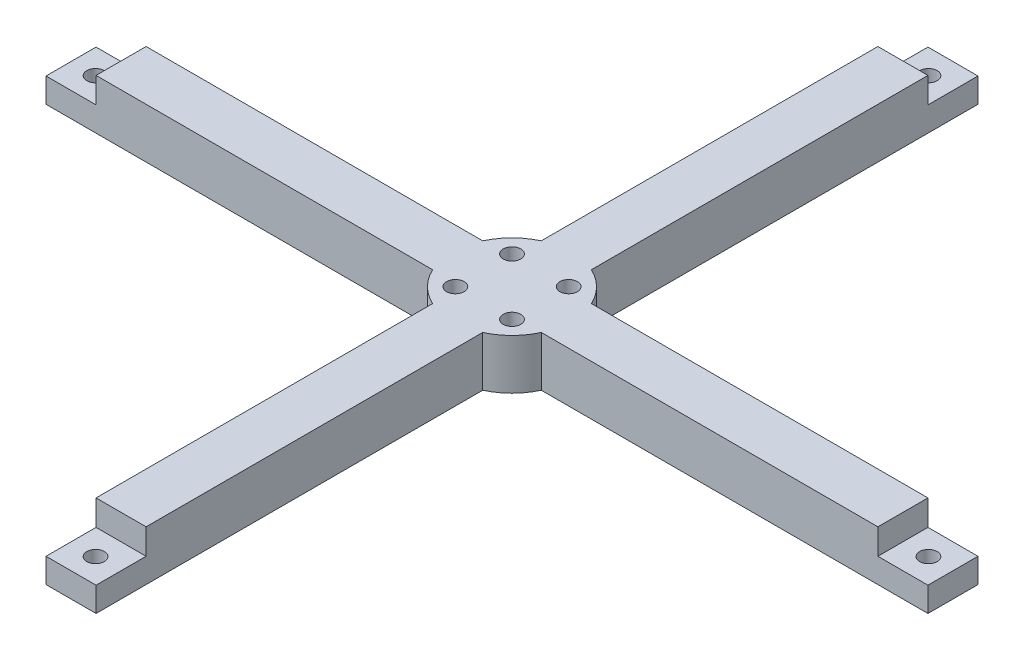
ISO-10303-21;
HEADER;
FILE_DESCRIPTION(('STEP AP214'),'2;1');
FILE_NAME('part.step','',(''),(''),'','','');
FILE_SCHEMA(('AUTOMOTIVE_DESIGN { 1 0 10303 214 1 1 1 1 }'));
ENDSEC;
DATA;
#1=APPLICATION_CONTEXT('core data for automotive mechanical design processes');
#2=APPLICATION_PROTOCOL_DEFINITION('international standard','automotive_design',2000,#1);
#3=PRODUCT_CONTEXT('',#1,'mechanical');
#4=PRODUCT('Part','Part','',(#3));
#5=PRODUCT_RELATED_PRODUCT_CATEGORY('part','',(#4));
#6=PRODUCT_DEFINITION_FORMATION('','',#4);
#7=PRODUCT_DEFINITION_CONTEXT('part definition',#1,'design');
#8=PRODUCT_DEFINITION('design','',#6,#7);
#9=PRODUCT_DEFINITION_SHAPE('','',#8);
#10=(LENGTH_UNIT() NAMED_UNIT(*) SI_UNIT(.MILLI.,.METRE.));
#11=(NAMED_UNIT(*) PLANE_ANGLE_UNIT() SI_UNIT($,.RADIAN.));
#12=(NAMED_UNIT(*) SI_UNIT($,.STERADIAN.) SOLID_ANGLE_UNIT());
#13=UNCERTAINTY_MEASURE_WITH_UNIT(LENGTH_MEASURE(1.E-05),#10,'distance_accuracy_value','');
#14=(GEOMETRIC_REPRESENTATION_CONTEXT(3) GLOBAL_UNCERTAINTY_ASSIGNED_CONTEXT((#13)) GLOBAL_UNIT_ASSIGNED_CONTEXT((#10,
#11,#12)) REPRESENTATION_CONTEXT('',''));
#15=CARTESIAN_POINT('',(0.,0.,0.));
#16=DIRECTION('',(0.,0.,1.));
#17=DIRECTION('',(1.,0.,0.));
#18=AXIS2_PLACEMENT_3D('',#15,#16,#17);
#19=CARTESIAN_POINT('',(0.,10.,0.));
#20=DIRECTION('',(0.,-1.,0.));
#21=DIRECTION('',(0.,0.,-1.));
#22=AXIS2_PLACEMENT_3D('',#19,#20,#21);
#23=CYLINDRICAL_SURFACE('',#22,11.95);
#24=CARTESIAN_POINT('',(0.,0.,0.));
#25=DIRECTION('',(0.,1.,0.));
#26=DIRECTION('',(0.,0.,1.));
#27=AXIS2_PLACEMENT_3D('',#24,#25,#26);
#28=CIRCLE('',#27,11.95);
#29=CARTESIAN_POINT('',(-10.8536860098309,0.,5.));
#30=VERTEX_POINT('',#29);
#31=CARTESIAN_POINT('',(-4.99999999999989,0.,10.853686009831));
#32=VERTEX_POINT('',#31);
#33=EDGE_CURVE('E788',#30,#32,#28,.T.);
#34=ORIENTED_EDGE('',*,*,#33,.T.);
#35=DIRECTION('',(0.,1.,0.));
#36=VECTOR('',#35,1.);
#37=CARTESIAN_POINT('',(-4.99999999999989,-87.9168844288129,10.853686009831));
#38=LINE('',#37,#36);
#39=CARTESIAN_POINT('',(-4.99999999999989,10.,10.853686009831));
#40=VERTEX_POINT('',#39);
#41=EDGE_CURVE('E378',#32,#40,#38,.T.);
#42=ORIENTED_EDGE('',*,*,#41,.T.);
#43=CARTESIAN_POINT('',(0.,10.,0.));
#44=DIRECTION('',(0.,1.,0.));
#45=DIRECTION('',(0.,0.,1.));
#46=AXIS2_PLACEMENT_3D('',#43,#44,#45);
#47=CIRCLE('',#46,11.95);
#48=CARTESIAN_POINT('',(-10.8536860098309,10.,5.));
#49=VERTEX_POINT('',#48);
#50=EDGE_CURVE('E323',#49,#40,#47,.T.);
#51=ORIENTED_EDGE('',*,*,#50,.F.);
#52=DIRECTION('',(0.,1.,0.));
#53=VECTOR('',#52,1.);
#54=CARTESIAN_POINT('',(-10.8536860098309,-87.9168844288127,5.));
#55=LINE('',#54,#53);
#56=EDGE_CURVE('E363',#30,#49,#55,.T.);
#57=ORIENTED_EDGE('',*,*,#56,.F.);
#58=EDGE_LOOP('',(#34,#42,#51,#57));
#59=FACE_BOUND('',#58,.T.);
#60=ADVANCED_FACE('F37',(#59),#23,.T.);
#61=CARTESIAN_POINT('',(-5.00000000000004,0.,-10.8536860098309));
#62=VERTEX_POINT('',#61);
#63=CARTESIAN_POINT('',(-10.8536860098309,0.,-5.));
#64=VERTEX_POINT('',#63);
#65=EDGE_CURVE('E284',#62,#64,#28,.T.);
#66=ORIENTED_EDGE('',*,*,#65,.T.);
#67=DIRECTION('',(0.,1.,0.));
#68=VECTOR('',#67,1.);
#69=CARTESIAN_POINT('',(-10.8536860098309,-87.9168844288127,-5.));
#70=LINE('',#69,#68);
#71=CARTESIAN_POINT('',(-10.8536860098309,10.,-5.));
#72=VERTEX_POINT('',#71);
#73=EDGE_CURVE('E322',#64,#72,#70,.T.);
#74=ORIENTED_EDGE('',*,*,#73,.T.);
#75=CARTESIAN_POINT('',(-5.00000000000004,10.,-10.8536860098309));
#76=VERTEX_POINT('',#75);
#77=EDGE_CURVE('E279',#76,#72,#47,.T.);
#78=ORIENTED_EDGE('',*,*,#77,.F.);
#79=DIRECTION('',(0.,1.,0.));
#80=VECTOR('',#79,1.);
#81=CARTESIAN_POINT('',(-5.00000000000004,-87.9168844288127,-10.8536860098309));
#82=LINE('',#81,#80);
#83=EDGE_CURVE('E221',#62,#76,#82,.T.);
#84=ORIENTED_EDGE('',*,*,#83,.F.);
#85=EDGE_LOOP('',(#66,#74,#78,#84));
#86=FACE_BOUND('',#85,.T.);
#87=ADVANCED_FACE('F320',(#86),#23,.T.);
#88=CARTESIAN_POINT('',(10.8536860098309,0.,-5.));
#89=VERTEX_POINT('',#88);
#90=CARTESIAN_POINT('',(4.99999999999996,0.,-10.853686009831));
#91=VERTEX_POINT('',#90);
#92=EDGE_CURVE('E281',#89,#91,#28,.T.);
#93=ORIENTED_EDGE('',*,*,#92,.T.);
#94=DIRECTION('',(0.,1.,0.));
#95=VECTOR('',#94,1.);
#96=CARTESIAN_POINT('',(4.99999999999996,-87.9168844288127,-10.853686009831));
#97=LINE('',#96,#95);
#98=CARTESIAN_POINT('',(4.99999999999996,10.,-10.853686009831));
#99=VERTEX_POINT('',#98);
#100=EDGE_CURVE('E225',#91,#99,#97,.T.);
#101=ORIENTED_EDGE('',*,*,#100,.T.);
#102=CARTESIAN_POINT('',(10.8536860098309,10.,-5.));
#103=VERTEX_POINT('',#102);
#104=EDGE_CURVE('E220',#103,#99,#47,.T.);
#105=ORIENTED_EDGE('',*,*,#104,.F.);
#106=DIRECTION('',(0.,1.,0.));
#107=VECTOR('',#106,1.);
#108=CARTESIAN_POINT('',(10.8536860098309,-87.9168844288127,-5.));
#109=LINE('',#108,#107);
#110=EDGE_CURVE('E269',#89,#103,#109,.T.);
#111=ORIENTED_EDGE('',*,*,#110,.F.);
#112=EDGE_LOOP('',(#93,#101,#105,#111));
#113=FACE_BOUND('',#112,.T.);
#114=ADVANCED_FACE('F355',(#113),#23,.T.);
#115=CARTESIAN_POINT('',(5.00000000000011,10.,10.8536860098309));
#116=VERTEX_POINT('',#115);
#117=CARTESIAN_POINT('',(10.8536860098309,10.,5.));
#118=VERTEX_POINT('',#117);
#119=EDGE_CURVE('E280',#116,#118,#47,.T.);
#120=ORIENTED_EDGE('',*,*,#119,.F.);
#121=DIRECTION('',(0.,1.,0.));
#122=VECTOR('',#121,1.);
#123=CARTESIAN_POINT('',(5.00000000000011,-87.9168844288129,10.8536860098309));
#124=LINE('',#123,#122);
#125=CARTESIAN_POINT('',(5.00000000000011,0.,10.8536860098309));
#126=VERTEX_POINT('',#125);
#127=EDGE_CURVE('E376',#126,#116,#124,.T.);
#128=ORIENTED_EDGE('',*,*,#127,.F.);
#129=CARTESIAN_POINT('',(10.8536860098309,0.,5.));
#130=VERTEX_POINT('',#129);
#131=EDGE_CURVE('E276',#126,#130,#28,.T.);
#132=ORIENTED_EDGE('',*,*,#131,.T.);
#133=DIRECTION('',(0.,1.,0.));
#134=VECTOR('',#133,1.);
#135=CARTESIAN_POINT('',(10.8536860098309,-87.9168844288127,5.));
#136=LINE('',#135,#134);
#137=EDGE_CURVE('E264',#130,#118,#136,.T.);
#138=ORIENTED_EDGE('',*,*,#137,.T.);
#139=EDGE_LOOP('',(#120,#128,#132,#138));
#140=FACE_BOUND('',#139,.T.);
#141=ADVANCED_FACE('F39',(#140),#23,.T.);
#142=CARTESIAN_POINT('',(0.,10.,0.));
#143=DIRECTION('',(0.,1.,0.));
#144=DIRECTION('',(0.,0.,1.));
#145=AXIS2_PLACEMENT_3D('',#142,#143,#144);
#146=PLANE('',#145);
#147=CARTESIAN_POINT('',(5.65685424949237,10.,-5.65685424949239));
#148=DIRECTION('',(0.,1.,0.));
#149=DIRECTION('',(0.,0.,1.));
#150=AXIS2_PLACEMENT_3D('',#147,#148,#149);
#151=CIRCLE('',#150,1.75);
#152=CARTESIAN_POINT('',(5.65685424949237,10.,-3.90685424949239));
#153=VERTEX_POINT('',#152);
#154=EDGE_CURVE('E446',#153,#153,#151,.T.);
#155=ORIENTED_EDGE('',*,*,#154,.F.);
#156=EDGE_LOOP('',(#155));
#157=FACE_BOUND('',#156,.T.);
#158=CARTESIAN_POINT('',(-5.65685424949239,10.,-5.65685424949237));
#159=DIRECTION('',(0.,1.,0.));
#160=DIRECTION('',(0.,0.,1.));
#161=AXIS2_PLACEMENT_3D('',#158,#159,#160);
#162=CIRCLE('',#161,1.75);
#163=CARTESIAN_POINT('',(-5.65685424949239,10.,-3.90685424949237));
#164=VERTEX_POINT('',#163);
#165=EDGE_CURVE('E452',#164,#164,#162,.T.);
#166=ORIENTED_EDGE('',*,*,#165,.F.);
#167=EDGE_LOOP('',(#166));
#168=FACE_BOUND('',#167,.T.);
#169=CARTESIAN_POINT('',(-5.65685424949237,10.,5.65685424949239));
#170=DIRECTION('',(0.,1.,0.));
#171=DIRECTION('',(0.,0.,1.));
#172=AXIS2_PLACEMENT_3D('',#169,#170,#171);
#173=CIRCLE('',#172,1.75);
#174=CARTESIAN_POINT('',(-5.65685424949237,10.,7.40685424949239));
#175=VERTEX_POINT('',#174);
#176=EDGE_CURVE('E458',#175,#175,#173,.T.);
#177=ORIENTED_EDGE('',*,*,#176,.F.);
#178=EDGE_LOOP('',(#177));
#179=FACE_BOUND('',#178,.T.);
#180=CARTESIAN_POINT('',(5.65685424949239,10.,5.65685424949237));
#181=DIRECTION('',(0.,1.,0.));
#182=DIRECTION('',(0.,0.,1.));
#183=AXIS2_PLACEMENT_3D('',#180,#181,#182);
#184=CIRCLE('',#183,1.75);
#185=CARTESIAN_POINT('',(5.65685424949239,10.,7.40685424949237));
#186=VERTEX_POINT('',#185);
#187=EDGE_CURVE('E440',#186,#186,#184,.T.);
#188=ORIENTED_EDGE('',*,*,#187,.F.);
#189=EDGE_LOOP('',(#188));
#190=FACE_BOUND('',#189,.T.);
#191=DIRECTION('',(1.,0.,0.));
#192=VECTOR('',#191,1.);
#193=CARTESIAN_POINT('',(-98.2000000000006,9.99999999999999,-78.0999999999996));
#194=LINE('',#193,#192);
#195=CARTESIAN_POINT('',(-5.00000000000031,9.99999999999999,-78.1));
#196=VERTEX_POINT('',#195);
#197=CARTESIAN_POINT('',(4.99999999999973,9.99999999999999,-78.1));
#198=VERTEX_POINT('',#197);
#199=EDGE_CURVE('E195',#196,#198,#194,.T.);
#200=ORIENTED_EDGE('',*,*,#199,.F.);
#201=DIRECTION('',(0.,0.,1.));
#202=VECTOR('',#201,1.);
#203=CARTESIAN_POINT('',(-5.00000000000004,10.,-10.8536860098309));
#204=LINE('',#203,#202);
#205=EDGE_CURVE('E222',#196,#76,#204,.T.);
#206=ORIENTED_EDGE('',*,*,#205,.T.);
#207=ORIENTED_EDGE('',*,*,#77,.T.);
#208=DIRECTION('',(-1.,0.,0.));
#209=VECTOR('',#208,1.);
#210=CARTESIAN_POINT('',(-10.8536860098309,10.,-5.));
#211=LINE('',#210,#209);
#212=CARTESIAN_POINT('',(-78.1,9.99999999999999,-5.));
#213=VERTEX_POINT('',#212);
#214=EDGE_CURVE('E366',#72,#213,#211,.T.);
#215=ORIENTED_EDGE('',*,*,#214,.T.);
#216=DIRECTION('',(0.,0.,-1.));
#217=VECTOR('',#216,1.);
#218=CARTESIAN_POINT('',(-78.1,9.99999999999999,98.2));
#219=LINE('',#218,#217);
#220=CARTESIAN_POINT('',(-78.1,9.99999999999999,5.00000000000003));
#221=VERTEX_POINT('',#220);
#222=EDGE_CURVE('E404',#221,#213,#219,.T.);
#223=ORIENTED_EDGE('',*,*,#222,.F.);
#224=DIRECTION('',(1.,0.,0.));
#225=VECTOR('',#224,1.);
#226=CARTESIAN_POINT('',(-10.8536860098309,10.,5.));
#227=LINE('',#226,#225);
#228=EDGE_CURVE('E369',#221,#49,#227,.T.);
#229=ORIENTED_EDGE('',*,*,#228,.T.);
#230=ORIENTED_EDGE('',*,*,#50,.T.);
#231=DIRECTION('',(0.,0.,1.));
#232=VECTOR('',#231,1.);
#233=CARTESIAN_POINT('',(-4.99999999999989,10.,10.853686009831));
#234=LINE('',#233,#232);
#235=CARTESIAN_POINT('',(-4.99999999999918,9.99999999999999,78.1000000000001));
#236=VERTEX_POINT('',#235);
#237=EDGE_CURVE('E379',#40,#236,#234,.T.);
#238=ORIENTED_EDGE('',*,*,#237,.T.);
#239=DIRECTION('',(-1.,0.,0.));
#240=VECTOR('',#239,1.);
#241=CARTESIAN_POINT('',(88.1000000000018,9.99999999999999,78.0999999999991));
#242=LINE('',#241,#240);
#243=CARTESIAN_POINT('',(5.00000000000092,9.99999999999999,78.1));
#244=VERTEX_POINT('',#243);
#245=EDGE_CURVE('E385',#244,#236,#242,.T.);
#246=ORIENTED_EDGE('',*,*,#245,.F.);
#247=DIRECTION('',(0.,0.,-1.));
#248=VECTOR('',#247,1.);
#249=CARTESIAN_POINT('',(5.00000000000011,10.,10.8536860098309));
#250=LINE('',#249,#248);
#251=EDGE_CURVE('E333',#244,#116,#250,.T.);
#252=ORIENTED_EDGE('',*,*,#251,.T.);
#253=ORIENTED_EDGE('',*,*,#119,.T.);
#254=DIRECTION('',(1.,0.,0.));
#255=VECTOR('',#254,1.);
#256=CARTESIAN_POINT('',(10.8536860098309,10.,5.));
#257=LINE('',#256,#255);
#258=CARTESIAN_POINT('',(78.1,9.99999999999999,5.));
#259=VERTEX_POINT('',#258);
#260=EDGE_CURVE('E266',#118,#259,#257,.T.);
#261=ORIENTED_EDGE('',*,*,#260,.T.);
#262=DIRECTION('',(0.,0.,1.));
#263=VECTOR('',#262,1.);
#264=CARTESIAN_POINT('',(78.1,9.99999999999999,-11.95));
#265=LINE('',#264,#263);
#266=CARTESIAN_POINT('',(78.1,9.99999999999999,-5.));
#267=VERTEX_POINT('',#266);
#268=EDGE_CURVE('E250',#267,#259,#265,.T.);
#269=ORIENTED_EDGE('',*,*,#268,.F.);
#270=DIRECTION('',(-1.,0.,0.));
#271=VECTOR('',#270,1.);
#272=CARTESIAN_POINT('',(10.8536860098309,10.,-5.));
#273=LINE('',#272,#271);
#274=EDGE_CURVE('E254',#267,#103,#273,.T.);
#275=ORIENTED_EDGE('',*,*,#274,.T.);
#276=ORIENTED_EDGE('',*,*,#104,.T.);
#277=DIRECTION('',(0.,0.,-1.));
#278=VECTOR('',#277,1.);
#279=CARTESIAN_POINT('',(4.99999999999996,10.,-10.853686009831));
#280=LINE('',#279,#278);
#281=EDGE_CURVE('E212',#99,#198,#280,.T.);
#282=ORIENTED_EDGE('',*,*,#281,.T.);
#283=EDGE_LOOP('',(#200,#206,#207,#215,#223,#229,#230,#238,#246,#252,#253,#261,#269,#275,#276,#282));
#284=FACE_BOUND('',#283,.T.);
#285=ADVANCED_FACE('F218',(#157,#168,#179,#190,#284),#146,.T.);
#286=CARTESIAN_POINT('',(0.,0.,0.));
#287=DIRECTION('',(0.,1.,0.));
#288=DIRECTION('',(0.,0.,1.));
#289=AXIS2_PLACEMENT_3D('',#286,#287,#288);
#290=PLANE('',#289);
#291=CARTESIAN_POINT('',(5.65685424949237,0.,-5.65685424949239));
#292=DIRECTION('',(0.,1.,0.));
#293=DIRECTION('',(0.,0.,1.));
#294=AXIS2_PLACEMENT_3D('',#291,#292,#293);
#295=CIRCLE('',#294,1.75);
#296=CARTESIAN_POINT('',(5.65685424949237,0.,-3.90685424949239));
#297=VERTEX_POINT('',#296);
#298=EDGE_CURVE('E449',#297,#297,#295,.T.);
#299=ORIENTED_EDGE('',*,*,#298,.T.);
#300=EDGE_LOOP('',(#299));
#301=FACE_BOUND('',#300,.T.);
#302=CARTESIAN_POINT('',(-5.65685424949239,0.,-5.65685424949237));
#303=DIRECTION('',(0.,1.,0.));
#304=DIRECTION('',(0.,0.,1.));
#305=AXIS2_PLACEMENT_3D('',#302,#303,#304);
#306=CIRCLE('',#305,1.75);
#307=CARTESIAN_POINT('',(-5.65685424949239,0.,-3.90685424949237));
#308=VERTEX_POINT('',#307);
#309=EDGE_CURVE('E455',#308,#308,#306,.T.);
#310=ORIENTED_EDGE('',*,*,#309,.T.);
#311=EDGE_LOOP('',(#310));
#312=FACE_BOUND('',#311,.T.);
#313=CARTESIAN_POINT('',(-5.65685424949237,0.,5.65685424949239));
#314=DIRECTION('',(0.,1.,0.));
#315=DIRECTION('',(0.,0.,1.));
#316=AXIS2_PLACEMENT_3D('',#313,#314,#315);
#317=CIRCLE('',#316,1.75);
#318=CARTESIAN_POINT('',(-5.65685424949237,0.,7.40685424949239));
#319=VERTEX_POINT('',#318);
#320=EDGE_CURVE('E443',#319,#319,#317,.T.);
#321=ORIENTED_EDGE('',*,*,#320,.T.);
#322=EDGE_LOOP('',(#321));
#323=FACE_BOUND('',#322,.T.);
#324=CARTESIAN_POINT('',(5.65685424949239,0.,5.65685424949237));
#325=DIRECTION('',(0.,1.,0.));
#326=DIRECTION('',(0.,0.,1.));
#327=AXIS2_PLACEMENT_3D('',#324,#325,#326);
#328=CIRCLE('',#327,1.75);
#329=CARTESIAN_POINT('',(5.65685424949239,0.,7.40685424949237));
#330=VERTEX_POINT('',#329);
#331=EDGE_CURVE('E435',#330,#330,#328,.T.);
#332=ORIENTED_EDGE('',*,*,#331,.T.);
#333=EDGE_LOOP('',(#332));
#334=FACE_BOUND('',#333,.T.);
#335=CARTESIAN_POINT('',(-2.89877930025075E-13,0.,-83.2));
#336=DIRECTION('',(0.,1.,0.));
#337=DIRECTION('',(0.,0.,1.));
#338=AXIS2_PLACEMENT_3D('',#335,#336,#337);
#339=CIRCLE('',#338,1.75000000000001);
#340=CARTESIAN_POINT('',(-2.89877930025075E-13,0.,-81.45));
#341=VERTEX_POINT('',#340);
#342=EDGE_CURVE('E427',#341,#341,#339,.T.);
#343=ORIENTED_EDGE('',*,*,#342,.T.);
#344=EDGE_LOOP('',(#343));
#345=FACE_BOUND('',#344,.T.);
#346=CARTESIAN_POINT('',(-83.2,0.,0.));
#347=DIRECTION('',(0.,1.,0.));
#348=DIRECTION('',(0.,0.,1.));
#349=AXIS2_PLACEMENT_3D('',#346,#347,#348);
#350=CIRCLE('',#349,1.75000000000001);
#351=CARTESIAN_POINT('',(-83.2,0.,1.75000000000001));
#352=VERTEX_POINT('',#351);
#353=EDGE_CURVE('E424',#352,#352,#350,.T.);
#354=ORIENTED_EDGE('',*,*,#353,.T.);
#355=EDGE_LOOP('',(#354));
#356=FACE_BOUND('',#355,.T.);
#357=CARTESIAN_POINT('',(8.70860424808573E-13,0.,83.2));
#358=DIRECTION('',(0.,1.,0.));
#359=DIRECTION('',(0.,0.,1.));
#360=AXIS2_PLACEMENT_3D('',#357,#358,#359);
#361=CIRCLE('',#360,1.75000000000001);
#362=CARTESIAN_POINT('',(8.70860424808573E-13,0.,84.95));
#363=VERTEX_POINT('',#362);
#364=EDGE_CURVE('E403',#363,#363,#361,.T.);
#365=ORIENTED_EDGE('',*,*,#364,.T.);
#366=EDGE_LOOP('',(#365));
#367=FACE_BOUND('',#366,.T.);
#368=CARTESIAN_POINT('',(83.2,0.,0.));
#369=DIRECTION('',(0.,1.,0.));
#370=DIRECTION('',(0.,0.,1.));
#371=AXIS2_PLACEMENT_3D('',#368,#369,#370);
#372=CIRCLE('',#371,1.75000000000001);
#373=CARTESIAN_POINT('',(83.2,0.,1.75000000000001));
#374=VERTEX_POINT('',#373);
#375=EDGE_CURVE('E239',#374,#374,#372,.T.);
#376=ORIENTED_EDGE('',*,*,#375,.T.);
#377=EDGE_LOOP('',(#376));
#378=FACE_BOUND('',#377,.T.);
#379=DIRECTION('',(0.,0.,-1.));
#380=VECTOR('',#379,1.);
#381=CARTESIAN_POINT('',(-5.00000000000004,0.,-10.8536860098309));
#382=LINE('',#381,#380);
#383=CARTESIAN_POINT('',(-5.00000000000031,0.,-88.1));
#384=VERTEX_POINT('',#383);
#385=EDGE_CURVE('E233',#62,#384,#382,.T.);
#386=ORIENTED_EDGE('',*,*,#385,.T.);
#387=DIRECTION('',(1.,0.,0.));
#388=VECTOR('',#387,1.);
#389=CARTESIAN_POINT('',(-98.2000000000006,0.,-88.0999999999997));
#390=LINE('',#389,#388);
#391=CARTESIAN_POINT('',(4.99999999999969,0.,-88.1));
#392=VERTEX_POINT('',#391);
#393=EDGE_CURVE('E383',#384,#392,#390,.T.);
#394=ORIENTED_EDGE('',*,*,#393,.T.);
#395=DIRECTION('',(0.,0.,1.));
#396=VECTOR('',#395,1.);
#397=CARTESIAN_POINT('',(4.99999999999996,0.,-10.853686009831));
#398=LINE('',#397,#396);
#399=EDGE_CURVE('E231',#392,#91,#398,.T.);
#400=ORIENTED_EDGE('',*,*,#399,.T.);
#401=ORIENTED_EDGE('',*,*,#92,.F.);
#402=DIRECTION('',(1.,0.,0.));
#403=VECTOR('',#402,1.);
#404=CARTESIAN_POINT('',(10.8536860098309,0.,-5.));
#405=LINE('',#404,#403);
#406=CARTESIAN_POINT('',(88.1,0.,-5.));
#407=VERTEX_POINT('',#406);
#408=EDGE_CURVE('E263',#89,#407,#405,.T.);
#409=ORIENTED_EDGE('',*,*,#408,.T.);
#410=DIRECTION('',(0.,0.,1.));
#411=VECTOR('',#410,1.);
#412=CARTESIAN_POINT('',(88.1,0.,-11.95));
#413=LINE('',#412,#411);
#414=CARTESIAN_POINT('',(88.1,0.,5.));
#415=VERTEX_POINT('',#414);
#416=EDGE_CURVE('E251',#407,#415,#413,.T.);
#417=ORIENTED_EDGE('',*,*,#416,.T.);
#418=DIRECTION('',(-1.,0.,0.));
#419=VECTOR('',#418,1.);
#420=CARTESIAN_POINT('',(10.8536860098309,0.,5.));
#421=LINE('',#420,#419);
#422=EDGE_CURVE('E260',#415,#130,#421,.T.);
#423=ORIENTED_EDGE('',*,*,#422,.T.);
#424=ORIENTED_EDGE('',*,*,#131,.F.);
#425=DIRECTION('',(0.,0.,1.));
#426=VECTOR('',#425,1.);
#427=CARTESIAN_POINT('',(5.00000000000011,0.,10.8536860098309));
#428=LINE('',#427,#426);
#429=CARTESIAN_POINT('',(5.00000000000092,0.,88.1));
#430=VERTEX_POINT('',#429);
#431=EDGE_CURVE('E371',#126,#430,#428,.T.);
#432=ORIENTED_EDGE('',*,*,#431,.T.);
#433=DIRECTION('',(-1.,0.,0.));
#434=VECTOR('',#433,1.);
#435=CARTESIAN_POINT('',(88.100000000002,0.,88.0999999999991));
#436=LINE('',#435,#434);
#437=CARTESIAN_POINT('',(-4.99999999999908,0.,88.1000000000001));
#438=VERTEX_POINT('',#437);
#439=EDGE_CURVE('E392',#430,#438,#436,.T.);
#440=ORIENTED_EDGE('',*,*,#439,.T.);
#441=DIRECTION('',(0.,0.,-1.));
#442=VECTOR('',#441,1.);
#443=CARTESIAN_POINT('',(-4.99999999999989,0.,10.853686009831));
#444=LINE('',#443,#442);
#445=EDGE_CURVE('E375',#438,#32,#444,.T.);
#446=ORIENTED_EDGE('',*,*,#445,.T.);
#447=ORIENTED_EDGE('',*,*,#33,.F.);
#448=DIRECTION('',(-1.,0.,0.));
#449=VECTOR('',#448,1.);
#450=CARTESIAN_POINT('',(-10.8536860098309,0.,5.));
#451=LINE('',#450,#449);
#452=CARTESIAN_POINT('',(-88.1,0.,5.00000000000003));
#453=VERTEX_POINT('',#452);
#454=EDGE_CURVE('E227',#30,#453,#451,.T.);
#455=ORIENTED_EDGE('',*,*,#454,.T.);
#456=DIRECTION('',(0.,0.,-1.));
#457=VECTOR('',#456,1.);
#458=CARTESIAN_POINT('',(-88.1,0.,98.2));
#459=LINE('',#458,#457);
#460=CARTESIAN_POINT('',(-88.1,0.,-5.));
#461=VERTEX_POINT('',#460);
#462=EDGE_CURVE('E215',#453,#461,#459,.T.);
#463=ORIENTED_EDGE('',*,*,#462,.T.);
#464=DIRECTION('',(1.,0.,0.));
#465=VECTOR('',#464,1.);
#466=CARTESIAN_POINT('',(-10.8536860098309,0.,-5.));
#467=LINE('',#466,#465);
#468=EDGE_CURVE('E362',#461,#64,#467,.T.);
#469=ORIENTED_EDGE('',*,*,#468,.T.);
#470=ORIENTED_EDGE('',*,*,#65,.F.);
#471=EDGE_LOOP('',(#386,#394,#400,#401,#409,#417,#423,#424,#432,#440,#446,#447,#455,#463,#469,#470));
#472=FACE_BOUND('',#471,.T.);
#473=ADVANCED_FACE('F464',(#301,#312,#323,#334,#345,#356,#367,#378,#472),#290,.F.);
#474=CARTESIAN_POINT('',(10.8536860098309,-87.9168844288127,5.));
#475=DIRECTION('',(0.,0.,1.));
#476=DIRECTION('',(1.,0.,0.));
#477=AXIS2_PLACEMENT_3D('',#474,#475,#476);
#478=PLANE('',#477);
#479=DIRECTION('',(0.,-1.,0.));
#480=VECTOR('',#479,1.);
#481=CARTESIAN_POINT('',(88.1,0.,5.));
#482=LINE('',#481,#480);
#483=CARTESIAN_POINT('',(88.1,4.9,5.));
#484=VERTEX_POINT('',#483);
#485=EDGE_CURVE('E248',#484,#415,#482,.T.);
#486=ORIENTED_EDGE('',*,*,#485,.F.);
#487=DIRECTION('',(1.,0.,0.));
#488=VECTOR('',#487,1.);
#489=CARTESIAN_POINT('',(88.1,4.9,5.));
#490=LINE('',#489,#488);
#491=CARTESIAN_POINT('',(78.1,4.89999999999999,5.));
#492=VERTEX_POINT('',#491);
#493=EDGE_CURVE('E245',#492,#484,#490,.T.);
#494=ORIENTED_EDGE('',*,*,#493,.F.);
#495=DIRECTION('',(0.,-1.,0.));
#496=VECTOR('',#495,1.);
#497=CARTESIAN_POINT('',(78.1,4.89999999999999,5.));
#498=LINE('',#497,#496);
#499=EDGE_CURVE('E242',#259,#492,#498,.T.);
#500=ORIENTED_EDGE('',*,*,#499,.F.);
#501=ORIENTED_EDGE('',*,*,#260,.F.);
#502=ORIENTED_EDGE('',*,*,#137,.F.);
#503=ORIENTED_EDGE('',*,*,#422,.F.);
#504=EDGE_LOOP('',(#486,#494,#500,#501,#502,#503));
#505=FACE_BOUND('',#504,.T.);
#506=ADVANCED_FACE('F342',(#505),#478,.T.);
#507=CARTESIAN_POINT('',(10.8536860098309,-87.9168844288127,-5.));
#508=DIRECTION('',(0.,0.,-1.));
#509=DIRECTION('',(-1.,0.,0.));
#510=AXIS2_PLACEMENT_3D('',#507,#508,#509);
#511=PLANE('',#510);
#512=DIRECTION('',(0.,1.,0.));
#513=VECTOR('',#512,1.);
#514=CARTESIAN_POINT('',(88.1,-87.9168844288127,-5.));
#515=LINE('',#514,#513);
#516=CARTESIAN_POINT('',(88.1,4.9,-5.));
#517=VERTEX_POINT('',#516);
#518=EDGE_CURVE('E289',#407,#517,#515,.T.);
#519=ORIENTED_EDGE('',*,*,#518,.F.);
#520=ORIENTED_EDGE('',*,*,#408,.F.);
#521=ORIENTED_EDGE('',*,*,#110,.T.);
#522=ORIENTED_EDGE('',*,*,#274,.F.);
#523=DIRECTION('',(0.,1.,0.));
#524=VECTOR('',#523,1.);
#525=CARTESIAN_POINT('',(78.1,-87.9168844288127,-5.));
#526=LINE('',#525,#524);
#527=CARTESIAN_POINT('',(78.1,4.9,-5.));
#528=VERTEX_POINT('',#527);
#529=EDGE_CURVE('E278',#528,#267,#526,.T.);
#530=ORIENTED_EDGE('',*,*,#529,.F.);
#531=DIRECTION('',(-1.,0.,0.));
#532=VECTOR('',#531,1.);
#533=CARTESIAN_POINT('',(10.8536860098309,4.89999999999999,-5.));
#534=LINE('',#533,#532);
#535=EDGE_CURVE('E286',#517,#528,#534,.T.);
#536=ORIENTED_EDGE('',*,*,#535,.F.);
#537=EDGE_LOOP('',(#519,#520,#521,#522,#530,#536));
#538=FACE_BOUND('',#537,.T.);
#539=ADVANCED_FACE('F350',(#538),#511,.T.);
#540=CARTESIAN_POINT('',(88.1,0.,-11.95));
#541=DIRECTION('',(-1.,0.,0.));
#542=DIRECTION('',(0.,0.,1.));
#543=AXIS2_PLACEMENT_3D('',#540,#541,#542);
#544=PLANE('',#543);
#545=ORIENTED_EDGE('',*,*,#518,.T.);
#546=DIRECTION('',(0.,0.,1.));
#547=VECTOR('',#546,1.);
#548=CARTESIAN_POINT('',(88.1,4.9,-11.95));
#549=LINE('',#548,#547);
#550=EDGE_CURVE('E255',#517,#484,#549,.T.);
#551=ORIENTED_EDGE('',*,*,#550,.T.);
#552=ORIENTED_EDGE('',*,*,#485,.T.);
#553=ORIENTED_EDGE('',*,*,#416,.F.);
#554=EDGE_LOOP('',(#545,#551,#552,#553));
#555=FACE_BOUND('',#554,.T.);
#556=ADVANCED_FACE('F538',(#555),#544,.F.);
#557=CARTESIAN_POINT('',(88.1,4.9,-11.95));
#558=DIRECTION('',(0.,-1.,0.));
#559=DIRECTION('',(1.,0.,0.));
#560=AXIS2_PLACEMENT_3D('',#557,#558,#559);
#561=PLANE('',#560);
#562=CARTESIAN_POINT('',(83.2,4.89999999999998,0.));
#563=DIRECTION('',(0.,1.,0.));
#564=DIRECTION('',(0.,0.,1.));
#565=AXIS2_PLACEMENT_3D('',#562,#563,#564);
#566=CIRCLE('',#565,1.75000000000001);
#567=CARTESIAN_POINT('',(83.2,4.89999999999998,1.75000000000001));
#568=VERTEX_POINT('',#567);
#569=EDGE_CURVE('E236',#568,#568,#566,.T.);
#570=ORIENTED_EDGE('',*,*,#569,.F.);
#571=EDGE_LOOP('',(#570));
#572=FACE_BOUND('',#571,.T.);
#573=ORIENTED_EDGE('',*,*,#535,.T.);
#574=DIRECTION('',(0.,0.,1.));
#575=VECTOR('',#574,1.);
#576=CARTESIAN_POINT('',(78.1,4.89999999999999,-11.95));
#577=LINE('',#576,#575);
#578=EDGE_CURVE('E257',#528,#492,#577,.T.);
#579=ORIENTED_EDGE('',*,*,#578,.T.);
#580=ORIENTED_EDGE('',*,*,#493,.T.);
#581=ORIENTED_EDGE('',*,*,#550,.F.);
#582=EDGE_LOOP('',(#573,#579,#580,#581));
#583=FACE_BOUND('',#582,.T.);
#584=ADVANCED_FACE('F533',(#572,#583),#561,.F.);
#585=CARTESIAN_POINT('',(78.1,4.89999999999999,-11.95));
#586=DIRECTION('',(-1.,0.,0.));
#587=DIRECTION('',(0.,0.,1.));
#588=AXIS2_PLACEMENT_3D('',#585,#586,#587);
#589=PLANE('',#588);
#590=ORIENTED_EDGE('',*,*,#529,.T.);
#591=ORIENTED_EDGE('',*,*,#268,.T.);
#592=ORIENTED_EDGE('',*,*,#499,.T.);
#593=ORIENTED_EDGE('',*,*,#578,.F.);
#594=EDGE_LOOP('',(#590,#591,#592,#593));
#595=FACE_BOUND('',#594,.T.);
#596=ADVANCED_FACE('F345',(#595),#589,.F.);
#597=CARTESIAN_POINT('',(83.2,-5.10000000000002,0.));
#598=DIRECTION('',(0.,1.,0.));
#599=DIRECTION('',(0.,0.,1.));
#600=AXIS2_PLACEMENT_3D('',#597,#598,#599);
#601=CYLINDRICAL_SURFACE('',#600,1.75000000000001);
#602=ORIENTED_EDGE('',*,*,#569,.T.);
#603=EDGE_LOOP('',(#602));
#604=FACE_BOUND('',#603,.T.);
#605=ORIENTED_EDGE('',*,*,#375,.F.);
#606=EDGE_LOOP('',(#605));
#607=FACE_BOUND('',#606,.T.);
#608=ADVANCED_FACE('F520',(#604,#607),#601,.F.);
#609=CARTESIAN_POINT('',(4.99999999999996,-87.9168844288127,-10.853686009831));
#610=DIRECTION('',(1.,0.,0.));
#611=DIRECTION('',(0.,0.,-1.));
#612=AXIS2_PLACEMENT_3D('',#609,#610,#611);
#613=PLANE('',#612);
#614=DIRECTION('',(0.,-1.,0.));
#615=VECTOR('',#614,1.);
#616=CARTESIAN_POINT('',(4.99999999999969,0.,-88.1));
#617=LINE('',#616,#615);
#618=CARTESIAN_POINT('',(4.99999999999969,4.9,-88.1));
#619=VERTEX_POINT('',#618);
#620=EDGE_CURVE('E205',#619,#392,#617,.T.);
#621=ORIENTED_EDGE('',*,*,#620,.F.);
#622=DIRECTION('',(0.,0.,-1.));
#623=VECTOR('',#622,1.);
#624=CARTESIAN_POINT('',(4.99999999999969,4.9,-88.1));
#625=LINE('',#624,#623);
#626=CARTESIAN_POINT('',(4.99999999999973,4.89999999999999,-78.1));
#627=VERTEX_POINT('',#626);
#628=EDGE_CURVE('E214',#627,#619,#625,.T.);
#629=ORIENTED_EDGE('',*,*,#628,.F.);
#630=DIRECTION('',(0.,-1.,0.));
#631=VECTOR('',#630,1.);
#632=CARTESIAN_POINT('',(4.99999999999973,4.89999999999999,-78.1));
#633=LINE('',#632,#631);
#634=EDGE_CURVE('E198',#198,#627,#633,.T.);
#635=ORIENTED_EDGE('',*,*,#634,.F.);
#636=ORIENTED_EDGE('',*,*,#281,.F.);
#637=ORIENTED_EDGE('',*,*,#100,.F.);
#638=ORIENTED_EDGE('',*,*,#399,.F.);
#639=EDGE_LOOP('',(#621,#629,#635,#636,#637,#638));
#640=FACE_BOUND('',#639,.T.);
#641=ADVANCED_FACE('F210',(#640),#613,.T.);
#642=CARTESIAN_POINT('',(-5.00000000000004,-87.9168844288127,-10.8536860098309));
#643=DIRECTION('',(-1.,0.,0.));
#644=DIRECTION('',(0.,0.,1.));
#645=AXIS2_PLACEMENT_3D('',#642,#643,#644);
#646=PLANE('',#645);
#647=DIRECTION('',(0.,1.,0.));
#648=VECTOR('',#647,1.);
#649=CARTESIAN_POINT('',(-5.00000000000031,-87.9168844288127,-88.1));
#650=LINE('',#649,#648);
#651=CARTESIAN_POINT('',(-5.0000000000003,4.9,-88.1));
#652=VERTEX_POINT('',#651);
#653=EDGE_CURVE('E11',#384,#652,#650,.T.);
#654=ORIENTED_EDGE('',*,*,#653,.F.);
#655=ORIENTED_EDGE('',*,*,#385,.F.);
#656=ORIENTED_EDGE('',*,*,#83,.T.);
#657=ORIENTED_EDGE('',*,*,#205,.F.);
#658=DIRECTION('',(0.,1.,0.));
#659=VECTOR('',#658,1.);
#660=CARTESIAN_POINT('',(-5.00000000000027,-87.9168844288127,-78.1));
#661=LINE('',#660,#659);
#662=CARTESIAN_POINT('',(-5.00000000000027,4.9,-78.1));
#663=VERTEX_POINT('',#662);
#664=EDGE_CURVE('E201',#663,#196,#661,.T.);
#665=ORIENTED_EDGE('',*,*,#664,.F.);
#666=DIRECTION('',(0.,0.,1.));
#667=VECTOR('',#666,1.);
#668=CARTESIAN_POINT('',(-5.00000000000004,4.89999999999999,-10.8536860098309));
#669=LINE('',#668,#667);
#670=EDGE_CURVE('E45',#652,#663,#669,.T.);
#671=ORIENTED_EDGE('',*,*,#670,.F.);
#672=EDGE_LOOP('',(#654,#655,#656,#657,#665,#671));
#673=FACE_BOUND('',#672,.T.);
#674=ADVANCED_FACE('F311',(#673),#646,.T.);
#675=CARTESIAN_POINT('',(-10.8536860098309,-87.9168844288127,-5.));
#676=DIRECTION('',(0.,0.,-1.));
#677=DIRECTION('',(-1.,0.,0.));
#678=AXIS2_PLACEMENT_3D('',#675,#676,#677);
#679=PLANE('',#678);
#680=DIRECTION('',(0.,-1.,0.));
#681=VECTOR('',#680,1.);
#682=CARTESIAN_POINT('',(-88.1,0.,-5.));
#683=LINE('',#682,#681);
#684=CARTESIAN_POINT('',(-88.1,4.9,-5.));
#685=VERTEX_POINT('',#684);
#686=EDGE_CURVE('E406',#685,#461,#683,.T.);
#687=ORIENTED_EDGE('',*,*,#686,.F.);
#688=DIRECTION('',(-1.,0.,0.));
#689=VECTOR('',#688,1.);
#690=CARTESIAN_POINT('',(-88.1,4.9,-5.));
#691=LINE('',#690,#689);
#692=CARTESIAN_POINT('',(-78.1,4.89999999999999,-5.));
#693=VERTEX_POINT('',#692);
#694=EDGE_CURVE('E413',#693,#685,#691,.T.);
#695=ORIENTED_EDGE('',*,*,#694,.F.);
#696=DIRECTION('',(0.,-1.,0.));
#697=VECTOR('',#696,1.);
#698=CARTESIAN_POINT('',(-78.1,4.89999999999999,-5.));
#699=LINE('',#698,#697);
#700=EDGE_CURVE('E395',#213,#693,#699,.T.);
#701=ORIENTED_EDGE('',*,*,#700,.F.);
#702=ORIENTED_EDGE('',*,*,#214,.F.);
#703=ORIENTED_EDGE('',*,*,#73,.F.);
#704=ORIENTED_EDGE('',*,*,#468,.F.);
#705=EDGE_LOOP('',(#687,#695,#701,#702,#703,#704));
#706=FACE_BOUND('',#705,.T.);
#707=ADVANCED_FACE('F726',(#706),#679,.T.);
#708=CARTESIAN_POINT('',(-10.8536860098309,-87.9168844288127,5.));
#709=DIRECTION('',(0.,0.,1.));
#710=DIRECTION('',(1.,0.,0.));
#711=AXIS2_PLACEMENT_3D('',#708,#709,#710);
#712=PLANE('',#711);
#713=DIRECTION('',(0.,1.,0.));
#714=VECTOR('',#713,1.);
#715=CARTESIAN_POINT('',(-88.1,-87.9168844288127,5.));
#716=LINE('',#715,#714);
#717=CARTESIAN_POINT('',(-88.1,4.9,5.00000000000003));
#718=VERTEX_POINT('',#717);
#719=EDGE_CURVE('E302',#453,#718,#716,.T.);
#720=ORIENTED_EDGE('',*,*,#719,.F.);
#721=ORIENTED_EDGE('',*,*,#454,.F.);
#722=ORIENTED_EDGE('',*,*,#56,.T.);
#723=ORIENTED_EDGE('',*,*,#228,.F.);
#724=DIRECTION('',(0.,1.,0.));
#725=VECTOR('',#724,1.);
#726=CARTESIAN_POINT('',(-78.1,-87.9168844288127,5.));
#727=LINE('',#726,#725);
#728=CARTESIAN_POINT('',(-78.1,4.9,5.));
#729=VERTEX_POINT('',#728);
#730=EDGE_CURVE('E298',#729,#221,#727,.T.);
#731=ORIENTED_EDGE('',*,*,#730,.F.);
#732=DIRECTION('',(1.,0.,0.));
#733=VECTOR('',#732,1.);
#734=CARTESIAN_POINT('',(-10.8536860098309,4.89999999999999,5.));
#735=LINE('',#734,#733);
#736=EDGE_CURVE('E300',#718,#729,#735,.T.);
#737=ORIENTED_EDGE('',*,*,#736,.F.);
#738=EDGE_LOOP('',(#720,#721,#722,#723,#731,#737));
#739=FACE_BOUND('',#738,.T.);
#740=ADVANCED_FACE('F716',(#739),#712,.T.);
#741=CARTESIAN_POINT('',(-4.99999999999989,-87.9168844288129,10.853686009831));
#742=DIRECTION('',(-1.,0.,0.));
#743=DIRECTION('',(0.,0.,1.));
#744=AXIS2_PLACEMENT_3D('',#741,#742,#743);
#745=PLANE('',#744);
#746=DIRECTION('',(0.,-1.,0.));
#747=VECTOR('',#746,1.);
#748=CARTESIAN_POINT('',(-4.99999999999908,0.,88.1000000000001));
#749=LINE('',#748,#747);
#750=CARTESIAN_POINT('',(-4.99999999999908,4.9,88.1000000000001));
#751=VERTEX_POINT('',#750);
#752=EDGE_CURVE('E388',#751,#438,#749,.T.);
#753=ORIENTED_EDGE('',*,*,#752,.F.);
#754=DIRECTION('',(0.,0.,1.));
#755=VECTOR('',#754,1.);
#756=CARTESIAN_POINT('',(-4.99999999999908,4.9,88.1000000000001));
#757=LINE('',#756,#755);
#758=CARTESIAN_POINT('',(-4.99999999999918,4.89999999999999,78.1000000000001));
#759=VERTEX_POINT('',#758);
#760=EDGE_CURVE('E397',#759,#751,#757,.T.);
#761=ORIENTED_EDGE('',*,*,#760,.F.);
#762=DIRECTION('',(0.,-1.,0.));
#763=VECTOR('',#762,1.);
#764=CARTESIAN_POINT('',(-4.99999999999918,4.89999999999999,78.1000000000001));
#765=LINE('',#764,#763);
#766=EDGE_CURVE('E400',#236,#759,#765,.T.);
#767=ORIENTED_EDGE('',*,*,#766,.F.);
#768=ORIENTED_EDGE('',*,*,#237,.F.);
#769=ORIENTED_EDGE('',*,*,#41,.F.);
#770=ORIENTED_EDGE('',*,*,#445,.F.);
#771=EDGE_LOOP('',(#753,#761,#767,#768,#769,#770));
#772=FACE_BOUND('',#771,.T.);
#773=ADVANCED_FACE('F706',(#772),#745,.T.);
#774=CARTESIAN_POINT('',(5.00000000000011,-87.9168844288129,10.8536860098309));
#775=DIRECTION('',(1.,0.,0.));
#776=DIRECTION('',(0.,0.,-1.));
#777=AXIS2_PLACEMENT_3D('',#774,#775,#776);
#778=PLANE('',#777);
#779=DIRECTION('',(0.,1.,0.));
#780=VECTOR('',#779,1.);
#781=CARTESIAN_POINT('',(5.00000000000092,-87.9168844288129,88.1));
#782=LINE('',#781,#780);
#783=CARTESIAN_POINT('',(5.00000000000087,4.9,88.1));
#784=VERTEX_POINT('',#783);
#785=EDGE_CURVE('E296',#430,#784,#782,.T.);
#786=ORIENTED_EDGE('',*,*,#785,.F.);
#787=ORIENTED_EDGE('',*,*,#431,.F.);
#788=ORIENTED_EDGE('',*,*,#127,.T.);
#789=ORIENTED_EDGE('',*,*,#251,.F.);
#790=DIRECTION('',(0.,1.,0.));
#791=VECTOR('',#790,1.);
#792=CARTESIAN_POINT('',(5.00000000000082,-87.9168844288129,78.1));
#793=LINE('',#792,#791);
#794=CARTESIAN_POINT('',(5.00000000000082,4.9,78.1));
#795=VERTEX_POINT('',#794);
#796=EDGE_CURVE('E291',#795,#244,#793,.T.);
#797=ORIENTED_EDGE('',*,*,#796,.F.);
#798=DIRECTION('',(0.,0.,-1.));
#799=VECTOR('',#798,1.);
#800=CARTESIAN_POINT('',(5.00000000000011,4.89999999999999,10.8536860098309));
#801=LINE('',#800,#799);
#802=EDGE_CURVE('E293',#784,#795,#801,.T.);
#803=ORIENTED_EDGE('',*,*,#802,.F.);
#804=EDGE_LOOP('',(#786,#787,#788,#789,#797,#803));
#805=FACE_BOUND('',#804,.T.);
#806=ADVANCED_FACE('F696',(#805),#778,.T.);
#807=CARTESIAN_POINT('',(88.100000000002,0.,88.0999999999991));
#808=DIRECTION('',(0.,0.,-1.));
#809=DIRECTION('',(-1.,0.,0.));
#810=AXIS2_PLACEMENT_3D('',#807,#808,#809);
#811=PLANE('',#810);
#812=ORIENTED_EDGE('',*,*,#785,.T.);
#813=DIRECTION('',(-1.,0.,0.));
#814=VECTOR('',#813,1.);
#815=CARTESIAN_POINT('',(88.100000000002,4.9,88.0999999999991));
#816=LINE('',#815,#814);
#817=EDGE_CURVE('E390',#784,#751,#816,.T.);
#818=ORIENTED_EDGE('',*,*,#817,.T.);
#819=ORIENTED_EDGE('',*,*,#752,.T.);
#820=ORIENTED_EDGE('',*,*,#439,.F.);
#821=EDGE_LOOP('',(#812,#818,#819,#820));
#822=FACE_BOUND('',#821,.T.);
#823=ADVANCED_FACE('F686',(#822),#811,.F.);
#824=CARTESIAN_POINT('',(88.100000000002,4.9,88.0999999999991));
#825=DIRECTION('',(0.,-1.,0.));
#826=DIRECTION('',(0.,0.,-1.));
#827=AXIS2_PLACEMENT_3D('',#824,#825,#826);
#828=PLANE('',#827);
#829=CARTESIAN_POINT('',(8.70860424808573E-13,4.89999999999998,83.2));
#830=DIRECTION('',(0.,1.,0.));
#831=DIRECTION('',(-1.,0.,0.));
#832=AXIS2_PLACEMENT_3D('',#829,#830,#831);
#833=CIRCLE('',#832,1.75000000000001);
#834=CARTESIAN_POINT('',(-1.74999999999914,4.89999999999998,83.2));
#835=VERTEX_POINT('',#834);
#836=EDGE_CURVE('E431',#835,#835,#833,.T.);
#837=ORIENTED_EDGE('',*,*,#836,.F.);
#838=EDGE_LOOP('',(#837));
#839=FACE_BOUND('',#838,.T.);
#840=ORIENTED_EDGE('',*,*,#802,.T.);
#841=DIRECTION('',(-1.,0.,0.));
#842=VECTOR('',#841,1.);
#843=CARTESIAN_POINT('',(88.1000000000018,4.89999999999999,78.0999999999991));
#844=LINE('',#843,#842);
#845=EDGE_CURVE('E387',#795,#759,#844,.T.);
#846=ORIENTED_EDGE('',*,*,#845,.T.);
#847=ORIENTED_EDGE('',*,*,#760,.T.);
#848=ORIENTED_EDGE('',*,*,#817,.F.);
#849=EDGE_LOOP('',(#840,#846,#847,#848));
#850=FACE_BOUND('',#849,.T.);
#851=ADVANCED_FACE('F676',(#839,#850),#828,.F.);
#852=CARTESIAN_POINT('',(88.1000000000018,4.89999999999999,78.0999999999991));
#853=DIRECTION('',(0.,0.,-1.));
#854=DIRECTION('',(-1.,0.,0.));
#855=AXIS2_PLACEMENT_3D('',#852,#853,#854);
#856=PLANE('',#855);
#857=ORIENTED_EDGE('',*,*,#796,.T.);
#858=ORIENTED_EDGE('',*,*,#245,.T.);
#859=ORIENTED_EDGE('',*,*,#766,.T.);
#860=ORIENTED_EDGE('',*,*,#845,.F.);
#861=EDGE_LOOP('',(#857,#858,#859,#860));
#862=FACE_BOUND('',#861,.T.);
#863=ADVANCED_FACE('F666',(#862),#856,.F.);
#864=CARTESIAN_POINT('',(-88.1,0.,98.2));
#865=DIRECTION('',(1.,0.,0.));
#866=DIRECTION('',(0.,0.,-1.));
#867=AXIS2_PLACEMENT_3D('',#864,#865,#866);
#868=PLANE('',#867);
#869=ORIENTED_EDGE('',*,*,#719,.T.);
#870=DIRECTION('',(0.,0.,-1.));
#871=VECTOR('',#870,1.);
#872=CARTESIAN_POINT('',(-88.1,4.9,98.2));
#873=LINE('',#872,#871);
#874=EDGE_CURVE('E408',#718,#685,#873,.T.);
#875=ORIENTED_EDGE('',*,*,#874,.T.);
#876=ORIENTED_EDGE('',*,*,#686,.T.);
#877=ORIENTED_EDGE('',*,*,#462,.F.);
#878=EDGE_LOOP('',(#869,#875,#876,#877));
#879=FACE_BOUND('',#878,.T.);
#880=ADVANCED_FACE('F656',(#879),#868,.F.);
#881=CARTESIAN_POINT('',(-88.1,4.9,98.2));
#882=DIRECTION('',(0.,-1.,0.));
#883=DIRECTION('',(1.,0.,0.));
#884=AXIS2_PLACEMENT_3D('',#881,#882,#883);
#885=PLANE('',#884);
#886=CARTESIAN_POINT('',(-83.2,4.89999999999998,0.));
#887=DIRECTION('',(0.,1.,0.));
#888=DIRECTION('',(0.,0.,-1.));
#889=AXIS2_PLACEMENT_3D('',#886,#887,#888);
#890=CIRCLE('',#889,1.75000000000001);
#891=CARTESIAN_POINT('',(-83.2,4.89999999999998,-1.75000000000001));
#892=VERTEX_POINT('',#891);
#893=EDGE_CURVE('E434',#892,#892,#890,.T.);
#894=ORIENTED_EDGE('',*,*,#893,.F.);
#895=EDGE_LOOP('',(#894));
#896=FACE_BOUND('',#895,.T.);
#897=ORIENTED_EDGE('',*,*,#736,.T.);
#898=DIRECTION('',(0.,0.,-1.));
#899=VECTOR('',#898,1.);
#900=CARTESIAN_POINT('',(-78.1,4.89999999999999,98.2));
#901=LINE('',#900,#899);
#902=EDGE_CURVE('E60',#729,#693,#901,.T.);
#903=ORIENTED_EDGE('',*,*,#902,.T.);
#904=ORIENTED_EDGE('',*,*,#694,.T.);
#905=ORIENTED_EDGE('',*,*,#874,.F.);
#906=EDGE_LOOP('',(#897,#903,#904,#905));
#907=FACE_BOUND('',#906,.T.);
#908=ADVANCED_FACE('F647',(#896,#907),#885,.F.);
#909=CARTESIAN_POINT('',(-78.1,4.89999999999999,98.2));
#910=DIRECTION('',(1.,0.,0.));
#911=DIRECTION('',(0.,0.,-1.));
#912=AXIS2_PLACEMENT_3D('',#909,#910,#911);
#913=PLANE('',#912);
#914=ORIENTED_EDGE('',*,*,#730,.T.);
#915=ORIENTED_EDGE('',*,*,#222,.T.);
#916=ORIENTED_EDGE('',*,*,#700,.T.);
#917=ORIENTED_EDGE('',*,*,#902,.F.);
#918=EDGE_LOOP('',(#914,#915,#916,#917));
#919=FACE_BOUND('',#918,.T.);
#920=ADVANCED_FACE('F637',(#919),#913,.F.);
#921=CARTESIAN_POINT('',(-98.2000000000006,0.,-88.0999999999997));
#922=DIRECTION('',(0.,0.,1.));
#923=DIRECTION('',(1.,0.,0.));
#924=AXIS2_PLACEMENT_3D('',#921,#922,#923);
#925=PLANE('',#924);
#926=ORIENTED_EDGE('',*,*,#653,.T.);
#927=DIRECTION('',(1.,0.,0.));
#928=VECTOR('',#927,1.);
#929=CARTESIAN_POINT('',(-98.2000000000006,4.9,-88.0999999999997));
#930=LINE('',#929,#928);
#931=EDGE_CURVE('E308',#652,#619,#930,.T.);
#932=ORIENTED_EDGE('',*,*,#931,.T.);
#933=ORIENTED_EDGE('',*,*,#620,.T.);
#934=ORIENTED_EDGE('',*,*,#393,.F.);
#935=EDGE_LOOP('',(#926,#932,#933,#934));
#936=FACE_BOUND('',#935,.T.);
#937=ADVANCED_FACE('F627',(#936),#925,.F.);
#938=CARTESIAN_POINT('',(-98.2000000000006,4.9,-88.0999999999997));
#939=DIRECTION('',(0.,-1.,0.));
#940=DIRECTION('',(0.,0.,-1.));
#941=AXIS2_PLACEMENT_3D('',#938,#939,#940);
#942=PLANE('',#941);
#943=CARTESIAN_POINT('',(-2.89877930025075E-13,4.89999999999998,-83.2));
#944=DIRECTION('',(0.,1.,0.));
#945=DIRECTION('',(1.,0.,0.));
#946=AXIS2_PLACEMENT_3D('',#943,#944,#945);
#947=CIRCLE('',#946,1.75000000000001);
#948=CARTESIAN_POINT('',(1.74999999999972,4.89999999999998,-83.2));
#949=VERTEX_POINT('',#948);
#950=EDGE_CURVE('E430',#949,#949,#947,.T.);
#951=ORIENTED_EDGE('',*,*,#950,.F.);
#952=EDGE_LOOP('',(#951));
#953=FACE_BOUND('',#952,.T.);
#954=ORIENTED_EDGE('',*,*,#670,.T.);
#955=DIRECTION('',(1.,0.,0.));
#956=VECTOR('',#955,1.);
#957=CARTESIAN_POINT('',(-98.2000000000006,4.89999999999999,-78.0999999999996));
#958=LINE('',#957,#956);
#959=EDGE_CURVE('E52',#663,#627,#958,.T.);
#960=ORIENTED_EDGE('',*,*,#959,.T.);
#961=ORIENTED_EDGE('',*,*,#628,.T.);
#962=ORIENTED_EDGE('',*,*,#931,.F.);
#963=EDGE_LOOP('',(#954,#960,#961,#962));
#964=FACE_BOUND('',#963,.T.);
#965=ADVANCED_FACE('F307',(#953,#964),#942,.F.);
#966=CARTESIAN_POINT('',(-98.2000000000006,4.89999999999999,-78.0999999999996));
#967=DIRECTION('',(0.,0.,1.));
#968=DIRECTION('',(1.,0.,0.));
#969=AXIS2_PLACEMENT_3D('',#966,#967,#968);
#970=PLANE('',#969);
#971=ORIENTED_EDGE('',*,*,#664,.T.);
#972=ORIENTED_EDGE('',*,*,#199,.T.);
#973=ORIENTED_EDGE('',*,*,#634,.T.);
#974=ORIENTED_EDGE('',*,*,#959,.F.);
#975=EDGE_LOOP('',(#971,#972,#973,#974));
#976=FACE_BOUND('',#975,.T.);
#977=ADVANCED_FACE('F197',(#976),#970,.F.);
#978=CARTESIAN_POINT('',(-2.89877930025075E-13,-5.10000000000002,-83.2));
#979=DIRECTION('',(0.,1.,0.));
#980=DIRECTION('',(0.,0.,1.));
#981=AXIS2_PLACEMENT_3D('',#978,#979,#980);
#982=CYLINDRICAL_SURFACE('',#981,1.75000000000001);
#983=ORIENTED_EDGE('',*,*,#950,.T.);
#984=EDGE_LOOP('',(#983));
#985=FACE_BOUND('',#984,.T.);
#986=ORIENTED_EDGE('',*,*,#342,.F.);
#987=EDGE_LOOP('',(#986));
#988=FACE_BOUND('',#987,.T.);
#989=ADVANCED_FACE('F601',(#985,#988),#982,.F.);
#990=CARTESIAN_POINT('',(-83.2,-5.10000000000002,0.));
#991=DIRECTION('',(0.,1.,0.));
#992=DIRECTION('',(0.,0.,1.));
#993=AXIS2_PLACEMENT_3D('',#990,#991,#992);
#994=CYLINDRICAL_SURFACE('',#993,1.75000000000001);
#995=ORIENTED_EDGE('',*,*,#893,.T.);
#996=EDGE_LOOP('',(#995));
#997=FACE_BOUND('',#996,.T.);
#998=ORIENTED_EDGE('',*,*,#353,.F.);
#999=EDGE_LOOP('',(#998));
#1000=FACE_BOUND('',#999,.T.);
#1001=ADVANCED_FACE('F488',(#997,#1000),#994,.F.);
#1002=CARTESIAN_POINT('',(8.70860424808573E-13,-5.10000000000002,83.2));
#1003=DIRECTION('',(0.,1.,0.));
#1004=DIRECTION('',(0.,0.,1.));
#1005=AXIS2_PLACEMENT_3D('',#1002,#1003,#1004);
#1006=CYLINDRICAL_SURFACE('',#1005,1.75000000000001);
#1007=ORIENTED_EDGE('',*,*,#836,.T.);
#1008=EDGE_LOOP('',(#1007));
#1009=FACE_BOUND('',#1008,.T.);
#1010=ORIENTED_EDGE('',*,*,#364,.F.);
#1011=EDGE_LOOP('',(#1010));
#1012=FACE_BOUND('',#1011,.T.);
#1013=ADVANCED_FACE('F482',(#1009,#1012),#1006,.F.);
#1014=CARTESIAN_POINT('',(5.65685424949239,0.,5.65685424949237));
#1015=DIRECTION('',(0.,1.,0.));
#1016=DIRECTION('',(0.,0.,1.));
#1017=AXIS2_PLACEMENT_3D('',#1014,#1015,#1016);
#1018=CYLINDRICAL_SURFACE('',#1017,1.75);
#1019=ORIENTED_EDGE('',*,*,#331,.F.);
#1020=EDGE_LOOP('',(#1019));
#1021=FACE_BOUND('',#1020,.T.);
#1022=ORIENTED_EDGE('',*,*,#187,.T.);
#1023=EDGE_LOOP('',(#1022));
#1024=FACE_BOUND('',#1023,.T.);
#1025=ADVANCED_FACE('F471',(#1021,#1024),#1018,.F.);
#1026=CARTESIAN_POINT('',(-5.65685424949237,0.,5.65685424949239));
#1027=DIRECTION('',(0.,1.,0.));
#1028=DIRECTION('',(0.,0.,1.));
#1029=AXIS2_PLACEMENT_3D('',#1026,#1027,#1028);
#1030=CYLINDRICAL_SURFACE('',#1029,1.75);
#1031=ORIENTED_EDGE('',*,*,#320,.F.);
#1032=EDGE_LOOP('',(#1031));
#1033=FACE_BOUND('',#1032,.T.);
#1034=ORIENTED_EDGE('',*,*,#176,.T.);
#1035=EDGE_LOOP('',(#1034));
#1036=FACE_BOUND('',#1035,.T.);
#1037=ADVANCED_FACE('F467',(#1033,#1036),#1030,.F.);
#1038=CARTESIAN_POINT('',(-5.65685424949239,0.,-5.65685424949237));
#1039=DIRECTION('',(0.,1.,0.));
#1040=DIRECTION('',(0.,0.,1.));
#1041=AXIS2_PLACEMENT_3D('',#1038,#1039,#1040);
#1042=CYLINDRICAL_SURFACE('',#1041,1.75);
#1043=ORIENTED_EDGE('',*,*,#309,.F.);
#1044=EDGE_LOOP('',(#1043));
#1045=FACE_BOUND('',#1044,.T.);
#1046=ORIENTED_EDGE('',*,*,#165,.T.);
#1047=EDGE_LOOP('',(#1046));
#1048=FACE_BOUND('',#1047,.T.);
#1049=ADVANCED_FACE('F470',(#1045,#1048),#1042,.F.);
#1050=CARTESIAN_POINT('',(5.65685424949237,0.,-5.65685424949239));
#1051=DIRECTION('',(0.,1.,0.));
#1052=DIRECTION('',(0.,0.,1.));
#1053=AXIS2_PLACEMENT_3D('',#1050,#1051,#1052);
#1054=CYLINDRICAL_SURFACE('',#1053,1.75);
#1055=ORIENTED_EDGE('',*,*,#298,.F.);
#1056=EDGE_LOOP('',(#1055));
#1057=FACE_BOUND('',#1056,.T.);
#1058=ORIENTED_EDGE('',*,*,#154,.T.);
#1059=EDGE_LOOP('',(#1058));
#1060=FACE_BOUND('',#1059,.T.);
#1061=ADVANCED_FACE('F837',(#1057,#1060),#1054,.F.);
#1062=CLOSED_SHELL('',(#60,#87,#114,#141,#285,#473,#506,#539,#556,#584,#596,#608,#641,#674,#707,
#740,#773,#806,#823,#851,#863,#880,#908,#920,#937,#965,#977,#989,#1001,#1013,#1025,#1037,#1049,#1061));
#1063=MANIFOLD_SOLID_BREP('B2',#1062);
#1064=ADVANCED_BREP_SHAPE_REPRESENTATION('',(#18,#1063),#14);
#1065=SHAPE_DEFINITION_REPRESENTATION(#9,#1064);
ENDSEC;
END-ISO-10303-21;
